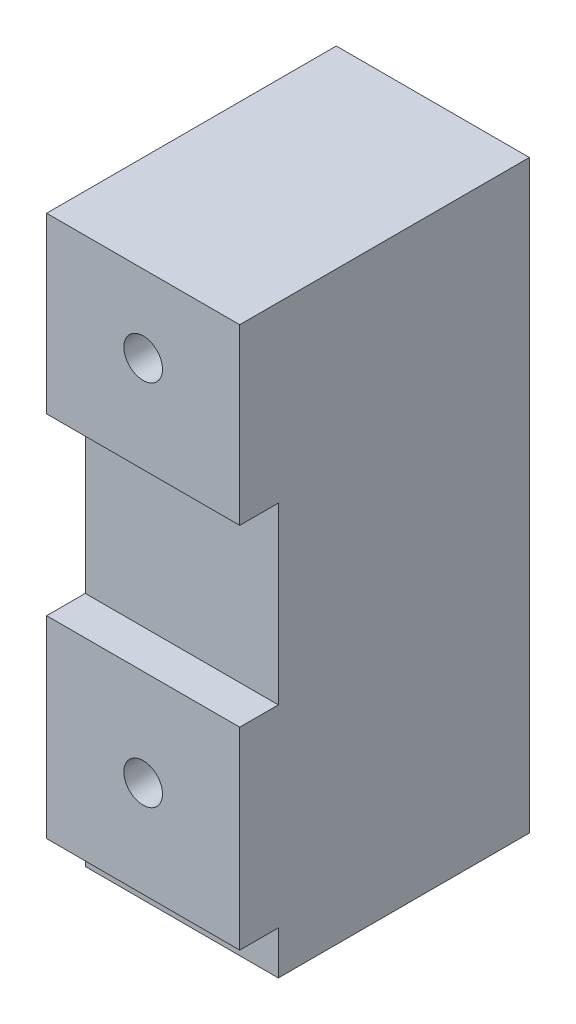
ISO-10303-21;
HEADER;
FILE_DESCRIPTION(('STEP AP214'),'2;1');
FILE_NAME('part.step','',(''),(''),'','','');
FILE_SCHEMA(('AUTOMOTIVE_DESIGN { 1 0 10303 214 1 1 1 1 }'));
ENDSEC;
DATA;
#1=APPLICATION_CONTEXT('core data for automotive mechanical design processes');
#2=APPLICATION_PROTOCOL_DEFINITION('international standard','automotive_design',2000,#1);
#3=PRODUCT_CONTEXT('',#1,'mechanical');
#4=PRODUCT('Part','Part','',(#3));
#5=PRODUCT_RELATED_PRODUCT_CATEGORY('part','',(#4));
#6=PRODUCT_DEFINITION_FORMATION('','',#4);
#7=PRODUCT_DEFINITION_CONTEXT('part definition',#1,'design');
#8=PRODUCT_DEFINITION('design','',#6,#7);
#9=PRODUCT_DEFINITION_SHAPE('','',#8);
#10=(LENGTH_UNIT() NAMED_UNIT(*) SI_UNIT(.MILLI.,.METRE.));
#11=(NAMED_UNIT(*) PLANE_ANGLE_UNIT() SI_UNIT($,.RADIAN.));
#12=(NAMED_UNIT(*) SI_UNIT($,.STERADIAN.) SOLID_ANGLE_UNIT());
#13=UNCERTAINTY_MEASURE_WITH_UNIT(LENGTH_MEASURE(1.E-05),#10,'distance_accuracy_value','');
#14=(GEOMETRIC_REPRESENTATION_CONTEXT(3) GLOBAL_UNCERTAINTY_ASSIGNED_CONTEXT((#13)) GLOBAL_UNIT_ASSIGNED_CONTEXT((#10,
#11,#12)) REPRESENTATION_CONTEXT('',''));
#15=CARTESIAN_POINT('',(0.,0.,0.));
#16=DIRECTION('',(0.,0.,1.));
#17=DIRECTION('',(1.,0.,0.));
#18=AXIS2_PLACEMENT_3D('',#15,#16,#17);
#19=CARTESIAN_POINT('',(5.,0.,-15.));
#20=DIRECTION('',(-1.,0.,0.));
#21=DIRECTION('',(0.,0.,1.));
#22=AXIS2_PLACEMENT_3D('',#19,#20,#21);
#23=PLANE('',#22);
#24=DIRECTION('',(0.,0.,1.));
#25=VECTOR('',#24,1.);
#26=CARTESIAN_POINT('',(5.,-5.,-2.));
#27=LINE('',#26,#25);
#28=CARTESIAN_POINT('',(5.,-5.,-2.));
#29=VERTEX_POINT('',#28);
#30=CARTESIAN_POINT('',(5.,-5.,0.));
#31=VERTEX_POINT('',#30);
#32=EDGE_CURVE('E68',#29,#31,#27,.T.);
#33=ORIENTED_EDGE('',*,*,#32,.F.);
#34=DIRECTION('',(0.,1.,0.));
#35=VECTOR('',#34,1.);
#36=CARTESIAN_POINT('',(5.,0.,-2.));
#37=LINE('',#36,#35);
#38=CARTESIAN_POINT('',(5.,-7.25,-2.));
#39=VERTEX_POINT('',#38);
#40=EDGE_CURVE('E149',#39,#29,#37,.T.);
#41=ORIENTED_EDGE('',*,*,#40,.F.);
#42=DIRECTION('',(0.,0.,1.));
#43=VECTOR('',#42,1.);
#44=CARTESIAN_POINT('',(5.,-7.25,-15.));
#45=LINE('',#44,#43);
#46=CARTESIAN_POINT('',(5.,-7.25,-15.));
#47=VERTEX_POINT('',#46);
#48=EDGE_CURVE('E12',#47,#39,#45,.T.);
#49=ORIENTED_EDGE('',*,*,#48,.F.);
#50=DIRECTION('',(0.,-1.,0.));
#51=VECTOR('',#50,1.);
#52=CARTESIAN_POINT('',(5.,0.,-15.));
#53=LINE('',#52,#51);
#54=CARTESIAN_POINT('',(5.,23.05,-15.));
#55=VERTEX_POINT('',#54);
#56=EDGE_CURVE('E165',#55,#47,#53,.T.);
#57=ORIENTED_EDGE('',*,*,#56,.F.);
#58=DIRECTION('',(0.,0.,1.));
#59=VECTOR('',#58,1.);
#60=CARTESIAN_POINT('',(5.,23.05,-15.));
#61=LINE('',#60,#59);
#62=CARTESIAN_POINT('',(5.,23.05,0.));
#63=VERTEX_POINT('',#62);
#64=EDGE_CURVE('E46',#55,#63,#61,.T.);
#65=ORIENTED_EDGE('',*,*,#64,.T.);
#66=DIRECTION('',(0.,-1.,0.));
#67=VECTOR('',#66,1.);
#68=CARTESIAN_POINT('',(5.,0.,0.));
#69=LINE('',#68,#67);
#70=CARTESIAN_POINT('',(4.99999999999999,14.05,0.));
#71=VERTEX_POINT('',#70);
#72=EDGE_CURVE('E180',#63,#71,#69,.T.);
#73=ORIENTED_EDGE('',*,*,#72,.T.);
#74=DIRECTION('',(0.,0.,1.));
#75=VECTOR('',#74,1.);
#76=CARTESIAN_POINT('',(4.99999999999999,14.05,-2.));
#77=LINE('',#76,#75);
#78=CARTESIAN_POINT('',(4.99999999999999,14.05,-2.));
#79=VERTEX_POINT('',#78);
#80=EDGE_CURVE('E147',#79,#71,#77,.T.);
#81=ORIENTED_EDGE('',*,*,#80,.F.);
#82=CARTESIAN_POINT('',(5.,5.,-2.));
#83=VERTEX_POINT('',#82);
#84=EDGE_CURVE('E138',#83,#79,#37,.T.);
#85=ORIENTED_EDGE('',*,*,#84,.F.);
#86=DIRECTION('',(0.,0.,1.));
#87=VECTOR('',#86,1.);
#88=CARTESIAN_POINT('',(5.,5.,-2.));
#89=LINE('',#88,#87);
#90=CARTESIAN_POINT('',(5.,5.,0.));
#91=VERTEX_POINT('',#90);
#92=EDGE_CURVE('E124',#83,#91,#89,.T.);
#93=ORIENTED_EDGE('',*,*,#92,.T.);
#94=EDGE_CURVE('E179',#91,#31,#69,.T.);
#95=ORIENTED_EDGE('',*,*,#94,.T.);
#96=EDGE_LOOP('',(#33,#41,#49,#57,#65,#73,#81,#85,#93,#95));
#97=FACE_BOUND('',#96,.T.);
#98=ADVANCED_FACE('F42',(#97),#23,.F.);
#99=CARTESIAN_POINT('',(0.,-7.25,-15.));
#100=DIRECTION('',(0.,-1.,0.));
#101=DIRECTION('',(0.,0.,-1.));
#102=AXIS2_PLACEMENT_3D('',#99,#100,#101);
#103=PLANE('',#102);
#104=ORIENTED_EDGE('',*,*,#48,.T.);
#105=DIRECTION('',(-1.,0.,0.));
#106=VECTOR('',#105,1.);
#107=CARTESIAN_POINT('',(0.,-7.25,-2.));
#108=LINE('',#107,#106);
#109=CARTESIAN_POINT('',(-5.00000000000001,-7.25,-2.));
#110=VERTEX_POINT('',#109);
#111=EDGE_CURVE('E154',#39,#110,#108,.T.);
#112=ORIENTED_EDGE('',*,*,#111,.T.);
#113=DIRECTION('',(0.,0.,1.));
#114=VECTOR('',#113,1.);
#115=CARTESIAN_POINT('',(-4.99999999999999,-7.25,-15.));
#116=LINE('',#115,#114);
#117=CARTESIAN_POINT('',(-4.99999999999999,-7.25,-15.));
#118=VERTEX_POINT('',#117);
#119=EDGE_CURVE('E52',#118,#110,#116,.T.);
#120=ORIENTED_EDGE('',*,*,#119,.F.);
#121=DIRECTION('',(1.,0.,0.));
#122=VECTOR('',#121,1.);
#123=CARTESIAN_POINT('',(0.,-7.25,-15.));
#124=LINE('',#123,#122);
#125=EDGE_CURVE('E173',#118,#47,#124,.T.);
#126=ORIENTED_EDGE('',*,*,#125,.T.);
#127=EDGE_LOOP('',(#104,#112,#120,#126));
#128=FACE_BOUND('',#127,.T.);
#129=ADVANCED_FACE('F226',(#128),#103,.T.);
#130=CARTESIAN_POINT('',(-5.,0.,-15.));
#131=DIRECTION('',(-1.,0.,0.));
#132=DIRECTION('',(0.,-1.,0.));
#133=AXIS2_PLACEMENT_3D('',#130,#131,#132);
#134=PLANE('',#133);
#135=DIRECTION('',(0.,0.,1.));
#136=VECTOR('',#135,1.);
#137=CARTESIAN_POINT('',(-5.,5.,-2.));
#138=LINE('',#137,#136);
#139=CARTESIAN_POINT('',(-5.,5.,-2.));
#140=VERTEX_POINT('',#139);
#141=CARTESIAN_POINT('',(-5.,5.,0.));
#142=VERTEX_POINT('',#141);
#143=EDGE_CURVE('E60',#140,#142,#138,.T.);
#144=ORIENTED_EDGE('',*,*,#143,.F.);
#145=DIRECTION('',(0.,1.,0.));
#146=VECTOR('',#145,1.);
#147=CARTESIAN_POINT('',(-5.,0.,-2.));
#148=LINE('',#147,#146);
#149=CARTESIAN_POINT('',(-4.99999999999999,14.05,-2.));
#150=VERTEX_POINT('',#149);
#151=EDGE_CURVE('E141',#140,#150,#148,.T.);
#152=ORIENTED_EDGE('',*,*,#151,.T.);
#153=DIRECTION('',(0.,0.,1.));
#154=VECTOR('',#153,1.);
#155=CARTESIAN_POINT('',(-4.99999999999999,14.05,-2.));
#156=LINE('',#155,#154);
#157=CARTESIAN_POINT('',(-4.99999999999999,14.05,0.));
#158=VERTEX_POINT('',#157);
#159=EDGE_CURVE('E210',#150,#158,#156,.T.);
#160=ORIENTED_EDGE('',*,*,#159,.T.);
#161=DIRECTION('',(0.,-1.,0.));
#162=VECTOR('',#161,1.);
#163=CARTESIAN_POINT('',(-5.,0.,0.));
#164=LINE('',#163,#162);
#165=CARTESIAN_POINT('',(-4.99999999999999,23.05,0.));
#166=VERTEX_POINT('',#165);
#167=EDGE_CURVE('E162',#166,#158,#164,.T.);
#168=ORIENTED_EDGE('',*,*,#167,.F.);
#169=DIRECTION('',(0.,0.,1.));
#170=VECTOR('',#169,1.);
#171=CARTESIAN_POINT('',(-4.99999999999999,23.05,-15.));
#172=LINE('',#171,#170);
#173=CARTESIAN_POINT('',(-4.99999999999999,23.05,-15.));
#174=VERTEX_POINT('',#173);
#175=EDGE_CURVE('E190',#174,#166,#172,.T.);
#176=ORIENTED_EDGE('',*,*,#175,.F.);
#177=DIRECTION('',(0.,-1.,0.));
#178=VECTOR('',#177,1.);
#179=CARTESIAN_POINT('',(-5.,0.,-15.));
#180=LINE('',#179,#178);
#181=EDGE_CURVE('E169',#174,#118,#180,.T.);
#182=ORIENTED_EDGE('',*,*,#181,.T.);
#183=ORIENTED_EDGE('',*,*,#119,.T.);
#184=CARTESIAN_POINT('',(-5.,-5.,-2.));
#185=VERTEX_POINT('',#184);
#186=EDGE_CURVE('E218',#110,#185,#148,.T.);
#187=ORIENTED_EDGE('',*,*,#186,.T.);
#188=DIRECTION('',(0.,0.,1.));
#189=VECTOR('',#188,1.);
#190=CARTESIAN_POINT('',(-5.,-5.,-2.));
#191=LINE('',#190,#189);
#192=CARTESIAN_POINT('',(-5.,-5.,0.));
#193=VERTEX_POINT('',#192);
#194=EDGE_CURVE('E212',#185,#193,#191,.T.);
#195=ORIENTED_EDGE('',*,*,#194,.T.);
#196=EDGE_CURVE('E185',#142,#193,#164,.T.);
#197=ORIENTED_EDGE('',*,*,#196,.F.);
#198=EDGE_LOOP('',(#144,#152,#160,#168,#176,#182,#183,#187,#195,#197));
#199=FACE_BOUND('',#198,.T.);
#200=ADVANCED_FACE('F229',(#199),#134,.T.);
#201=CARTESIAN_POINT('',(0.,0.,0.));
#202=DIRECTION('',(0.,0.,1.));
#203=DIRECTION('',(1.,0.,0.));
#204=AXIS2_PLACEMENT_3D('',#201,#202,#203);
#205=PLANE('',#204);
#206=CARTESIAN_POINT('',(0.,19.05,0.));
#207=DIRECTION('',(0.,0.,1.));
#208=DIRECTION('',(1.,0.,0.));
#209=AXIS2_PLACEMENT_3D('',#206,#207,#208);
#210=CIRCLE('',#209,1.);
#211=CARTESIAN_POINT('',(1.,19.05,0.));
#212=VERTEX_POINT('',#211);
#213=EDGE_CURVE('E148',#212,#212,#210,.T.);
#214=ORIENTED_EDGE('',*,*,#213,.F.);
#215=EDGE_LOOP('',(#214));
#216=FACE_BOUND('',#215,.T.);
#217=ORIENTED_EDGE('',*,*,#167,.T.);
#218=DIRECTION('',(1.,0.,0.));
#219=VECTOR('',#218,1.);
#220=CARTESIAN_POINT('',(-4.99999999999999,14.05,0.));
#221=LINE('',#220,#219);
#222=EDGE_CURVE('E203',#158,#71,#221,.T.);
#223=ORIENTED_EDGE('',*,*,#222,.T.);
#224=ORIENTED_EDGE('',*,*,#72,.F.);
#225=DIRECTION('',(1.,0.,0.));
#226=VECTOR('',#225,1.);
#227=CARTESIAN_POINT('',(0.,23.05,0.));
#228=LINE('',#227,#226);
#229=EDGE_CURVE('E182',#166,#63,#228,.T.);
#230=ORIENTED_EDGE('',*,*,#229,.F.);
#231=EDGE_LOOP('',(#217,#223,#224,#230));
#232=FACE_BOUND('',#231,.T.);
#233=ADVANCED_FACE('F202',(#216,#232),#205,.T.);
#234=CARTESIAN_POINT('',(0.,0.,0.));
#235=DIRECTION('',(0.,0.,1.));
#236=DIRECTION('',(1.,0.,0.));
#237=AXIS2_PLACEMENT_3D('',#234,#235,#236);
#238=CIRCLE('',#237,1.);
#239=CARTESIAN_POINT('',(1.,0.,0.));
#240=VERTEX_POINT('',#239);
#241=EDGE_CURVE('E152',#240,#240,#238,.T.);
#242=ORIENTED_EDGE('',*,*,#241,.F.);
#243=EDGE_LOOP('',(#242));
#244=FACE_BOUND('',#243,.T.);
#245=ORIENTED_EDGE('',*,*,#196,.T.);
#246=DIRECTION('',(1.,0.,0.));
#247=VECTOR('',#246,1.);
#248=CARTESIAN_POINT('',(-5.,-5.,0.));
#249=LINE('',#248,#247);
#250=EDGE_CURVE('E143',#193,#31,#249,.T.);
#251=ORIENTED_EDGE('',*,*,#250,.T.);
#252=ORIENTED_EDGE('',*,*,#94,.F.);
#253=DIRECTION('',(-1.,0.,0.));
#254=VECTOR('',#253,1.);
#255=CARTESIAN_POINT('',(-5.,5.,0.));
#256=LINE('',#255,#254);
#257=EDGE_CURVE('E128',#91,#142,#256,.T.);
#258=ORIENTED_EDGE('',*,*,#257,.T.);
#259=EDGE_LOOP('',(#245,#251,#252,#258));
#260=FACE_BOUND('',#259,.T.);
#261=ADVANCED_FACE('F247',(#244,#260),#205,.T.);
#262=CARTESIAN_POINT('',(0.,0.,-15.));
#263=DIRECTION('',(0.,0.,1.));
#264=DIRECTION('',(1.,0.,0.));
#265=AXIS2_PLACEMENT_3D('',#262,#263,#264);
#266=CYLINDRICAL_SURFACE('',#265,1.);
#267=CARTESIAN_POINT('',(0.,0.,-15.));
#268=DIRECTION('',(0.,0.,1.));
#269=DIRECTION('',(1.,0.,0.));
#270=AXIS2_PLACEMENT_3D('',#267,#268,#269);
#271=CIRCLE('',#270,1.);
#272=CARTESIAN_POINT('',(1.,0.,-15.));
#273=VERTEX_POINT('',#272);
#274=EDGE_CURVE('E161',#273,#273,#271,.T.);
#275=ORIENTED_EDGE('',*,*,#274,.F.);
#276=EDGE_LOOP('',(#275));
#277=FACE_BOUND('',#276,.T.);
#278=ORIENTED_EDGE('',*,*,#241,.T.);
#279=EDGE_LOOP('',(#278));
#280=FACE_BOUND('',#279,.T.);
#281=ADVANCED_FACE('F249',(#277,#280),#266,.F.);
#282=CARTESIAN_POINT('',(0.,19.05,-15.));
#283=DIRECTION('',(0.,0.,1.));
#284=DIRECTION('',(1.,0.,0.));
#285=AXIS2_PLACEMENT_3D('',#282,#283,#284);
#286=CYLINDRICAL_SURFACE('',#285,1.);
#287=CARTESIAN_POINT('',(0.,19.05,-15.));
#288=DIRECTION('',(0.,0.,1.));
#289=DIRECTION('',(1.,0.,0.));
#290=AXIS2_PLACEMENT_3D('',#287,#288,#289);
#291=CIRCLE('',#290,1.);
#292=CARTESIAN_POINT('',(1.,19.05,-15.));
#293=VERTEX_POINT('',#292);
#294=EDGE_CURVE('E158',#293,#293,#291,.T.);
#295=ORIENTED_EDGE('',*,*,#294,.F.);
#296=EDGE_LOOP('',(#295));
#297=FACE_BOUND('',#296,.T.);
#298=ORIENTED_EDGE('',*,*,#213,.T.);
#299=EDGE_LOOP('',(#298));
#300=FACE_BOUND('',#299,.T.);
#301=ADVANCED_FACE('F44',(#297,#300),#286,.F.);
#302=CARTESIAN_POINT('',(0.,23.05,-15.));
#303=DIRECTION('',(0.,-1.,0.));
#304=DIRECTION('',(0.,0.,-1.));
#305=AXIS2_PLACEMENT_3D('',#302,#303,#304);
#306=PLANE('',#305);
#307=ORIENTED_EDGE('',*,*,#229,.T.);
#308=ORIENTED_EDGE('',*,*,#64,.F.);
#309=DIRECTION('',(1.,0.,0.));
#310=VECTOR('',#309,1.);
#311=CARTESIAN_POINT('',(0.,23.05,-15.));
#312=LINE('',#311,#310);
#313=EDGE_CURVE('E167',#174,#55,#312,.T.);
#314=ORIENTED_EDGE('',*,*,#313,.F.);
#315=ORIENTED_EDGE('',*,*,#175,.T.);
#316=EDGE_LOOP('',(#307,#308,#314,#315));
#317=FACE_BOUND('',#316,.T.);
#318=ADVANCED_FACE('F198',(#317),#306,.F.);
#319=CARTESIAN_POINT('',(0.,0.,-15.));
#320=DIRECTION('',(0.,0.,1.));
#321=DIRECTION('',(1.,0.,0.));
#322=AXIS2_PLACEMENT_3D('',#319,#320,#321);
#323=PLANE('',#322);
#324=ORIENTED_EDGE('',*,*,#294,.T.);
#325=EDGE_LOOP('',(#324));
#326=FACE_BOUND('',#325,.T.);
#327=ORIENTED_EDGE('',*,*,#274,.T.);
#328=EDGE_LOOP('',(#327));
#329=FACE_BOUND('',#328,.T.);
#330=ORIENTED_EDGE('',*,*,#56,.T.);
#331=ORIENTED_EDGE('',*,*,#125,.F.);
#332=ORIENTED_EDGE('',*,*,#181,.F.);
#333=ORIENTED_EDGE('',*,*,#313,.T.);
#334=EDGE_LOOP('',(#330,#331,#332,#333));
#335=FACE_BOUND('',#334,.T.);
#336=ADVANCED_FACE('F233',(#326,#329,#335),#323,.F.);
#337=CARTESIAN_POINT('',(-4.99999999999999,14.05,-2.));
#338=DIRECTION('',(0.,-1.,0.));
#339=DIRECTION('',(1.,0.,0.));
#340=AXIS2_PLACEMENT_3D('',#337,#338,#339);
#341=PLANE('',#340);
#342=ORIENTED_EDGE('',*,*,#222,.F.);
#343=ORIENTED_EDGE('',*,*,#159,.F.);
#344=DIRECTION('',(1.,0.,0.));
#345=VECTOR('',#344,1.);
#346=CARTESIAN_POINT('',(-4.99999999999999,14.05,-2.));
#347=LINE('',#346,#345);
#348=EDGE_CURVE('E207',#150,#79,#347,.T.);
#349=ORIENTED_EDGE('',*,*,#348,.T.);
#350=ORIENTED_EDGE('',*,*,#80,.T.);
#351=EDGE_LOOP('',(#342,#343,#349,#350));
#352=FACE_BOUND('',#351,.T.);
#353=ADVANCED_FACE('F304',(#352),#341,.T.);
#354=CARTESIAN_POINT('',(-5.,5.,-2.));
#355=DIRECTION('',(0.,1.,0.));
#356=DIRECTION('',(-1.,0.,0.));
#357=AXIS2_PLACEMENT_3D('',#354,#355,#356);
#358=PLANE('',#357);
#359=ORIENTED_EDGE('',*,*,#257,.F.);
#360=ORIENTED_EDGE('',*,*,#92,.F.);
#361=DIRECTION('',(-1.,0.,0.));
#362=VECTOR('',#361,1.);
#363=CARTESIAN_POINT('',(-5.,5.,-2.));
#364=LINE('',#363,#362);
#365=EDGE_CURVE('E127',#83,#140,#364,.T.);
#366=ORIENTED_EDGE('',*,*,#365,.T.);
#367=ORIENTED_EDGE('',*,*,#143,.T.);
#368=EDGE_LOOP('',(#359,#360,#366,#367));
#369=FACE_BOUND('',#368,.T.);
#370=ADVANCED_FACE('F126',(#369),#358,.T.);
#371=CARTESIAN_POINT('',(0.,8.4,-2.));
#372=DIRECTION('',(0.,0.,1.));
#373=DIRECTION('',(1.,0.,0.));
#374=AXIS2_PLACEMENT_3D('',#371,#372,#373);
#375=PLANE('',#374);
#376=ORIENTED_EDGE('',*,*,#84,.T.);
#377=ORIENTED_EDGE('',*,*,#348,.F.);
#378=ORIENTED_EDGE('',*,*,#151,.F.);
#379=ORIENTED_EDGE('',*,*,#365,.F.);
#380=EDGE_LOOP('',(#376,#377,#378,#379));
#381=FACE_BOUND('',#380,.T.);
#382=ADVANCED_FACE('F136',(#381),#375,.T.);
#383=ORIENTED_EDGE('',*,*,#40,.T.);
#384=DIRECTION('',(1.,0.,0.));
#385=VECTOR('',#384,1.);
#386=CARTESIAN_POINT('',(-5.,-5.,-2.));
#387=LINE('',#386,#385);
#388=EDGE_CURVE('E133',#185,#29,#387,.T.);
#389=ORIENTED_EDGE('',*,*,#388,.F.);
#390=ORIENTED_EDGE('',*,*,#186,.F.);
#391=ORIENTED_EDGE('',*,*,#111,.F.);
#392=EDGE_LOOP('',(#383,#389,#390,#391));
#393=FACE_BOUND('',#392,.T.);
#394=ADVANCED_FACE('F235',(#393),#375,.T.);
#395=CARTESIAN_POINT('',(-5.,-5.,-2.));
#396=DIRECTION('',(0.,-1.,0.));
#397=DIRECTION('',(1.,0.,0.));
#398=AXIS2_PLACEMENT_3D('',#395,#396,#397);
#399=PLANE('',#398);
#400=ORIENTED_EDGE('',*,*,#250,.F.);
#401=ORIENTED_EDGE('',*,*,#194,.F.);
#402=ORIENTED_EDGE('',*,*,#388,.T.);
#403=ORIENTED_EDGE('',*,*,#32,.T.);
#404=EDGE_LOOP('',(#400,#401,#402,#403));
#405=FACE_BOUND('',#404,.T.);
#406=ADVANCED_FACE('F236',(#405),#399,.T.);
#407=CLOSED_SHELL('',(#98,#129,#200,#233,#261,#281,#301,#318,#336,#353,#370,#382,#394,#406));
#408=MANIFOLD_SOLID_BREP('B2',#407);
#409=ADVANCED_BREP_SHAPE_REPRESENTATION('',(#18,#408),#14);
#410=SHAPE_DEFINITION_REPRESENTATION(#9,#409);
ENDSEC;
END-ISO-10303-21;
